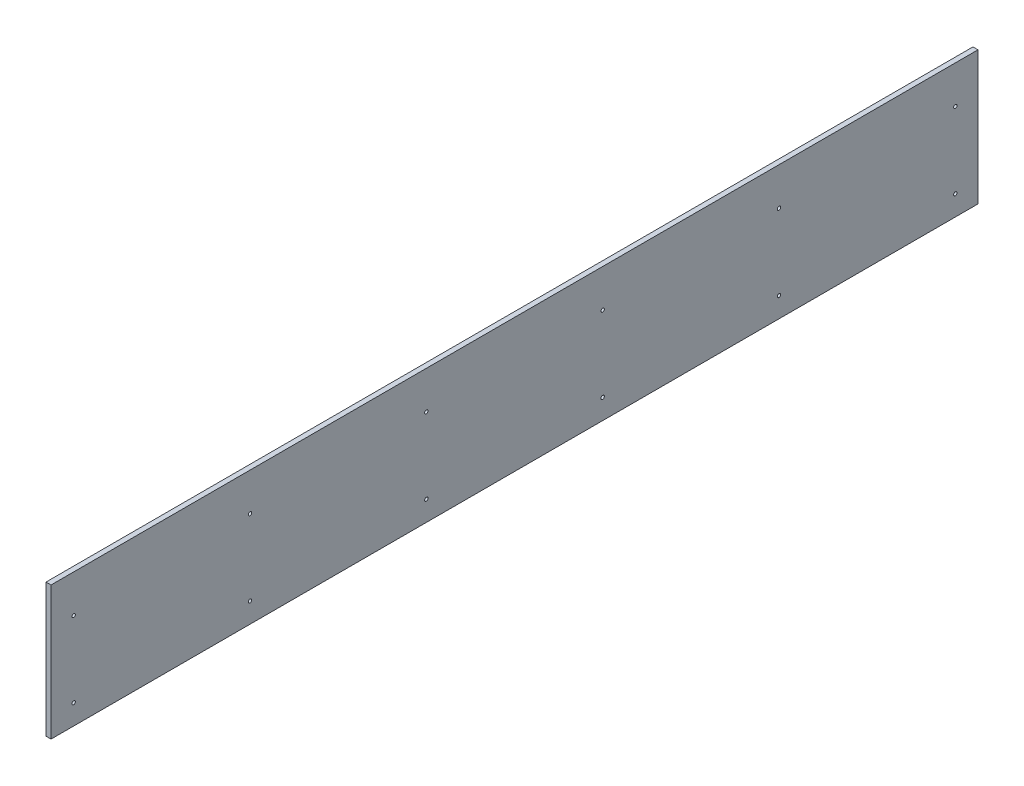
ISO-10303-21;
HEADER;
FILE_DESCRIPTION(('STEP AP214'),'2;1');
FILE_NAME('part.step','',(''),(''),'','','');
FILE_SCHEMA(('AUTOMOTIVE_DESIGN { 1 0 10303 214 1 1 1 1 }'));
ENDSEC;
DATA;
#1=APPLICATION_CONTEXT('core data for automotive mechanical design processes');
#2=APPLICATION_PROTOCOL_DEFINITION('international standard','automotive_design',2000,#1);
#3=PRODUCT_CONTEXT('',#1,'mechanical');
#4=PRODUCT('Part','Part','',(#3));
#5=PRODUCT_RELATED_PRODUCT_CATEGORY('part','',(#4));
#6=PRODUCT_DEFINITION_FORMATION('','',#4);
#7=PRODUCT_DEFINITION_CONTEXT('part definition',#1,'design');
#8=PRODUCT_DEFINITION('design','',#6,#7);
#9=PRODUCT_DEFINITION_SHAPE('','',#8);
#10=(LENGTH_UNIT() NAMED_UNIT(*) SI_UNIT(.MILLI.,.METRE.));
#11=(NAMED_UNIT(*) PLANE_ANGLE_UNIT() SI_UNIT($,.RADIAN.));
#12=(NAMED_UNIT(*) SI_UNIT($,.STERADIAN.) SOLID_ANGLE_UNIT());
#13=UNCERTAINTY_MEASURE_WITH_UNIT(LENGTH_MEASURE(1.E-05),#10,'distance_accuracy_value','');
#14=(GEOMETRIC_REPRESENTATION_CONTEXT(3) GLOBAL_UNCERTAINTY_ASSIGNED_CONTEXT((#13)) GLOBAL_UNIT_ASSIGNED_CONTEXT((#10,
#11,#12)) REPRESENTATION_CONTEXT('',''));
#15=CARTESIAN_POINT('',(0.,0.,0.));
#16=DIRECTION('',(0.,0.,1.));
#17=DIRECTION('',(1.,0.,0.));
#18=AXIS2_PLACEMENT_3D('',#15,#16,#17);
#19=CARTESIAN_POINT('',(0.,0.,0.));
#20=DIRECTION('',(1.,0.,0.));
#21=DIRECTION('',(0.,0.,-1.));
#22=AXIS2_PLACEMENT_3D('',#19,#20,#21);
#23=PLANE('',#22);
#24=CARTESIAN_POINT('',(0.,120.65,-28.575));
#25=DIRECTION('',(-1.,0.,0.));
#26=DIRECTION('',(0.,0.,1.));
#27=AXIS2_PLACEMENT_3D('',#24,#25,#26);
#28=CIRCLE('',#27,4.21640000006491);
#29=CARTESIAN_POINT('',(0.,120.65,-24.3585999999351));
#30=VERTEX_POINT('',#29);
#31=EDGE_CURVE('E68',#30,#30,#28,.F.);
#32=ORIENTED_EDGE('',*,*,#31,.T.);
#33=EDGE_LOOP('',(#32));
#34=FACE_BOUND('',#33,.T.);
#35=CARTESIAN_POINT('',(0.,120.65,-250.825));
#36=DIRECTION('',(-1.,0.,0.));
#37=DIRECTION('',(0.,0.,1.));
#38=AXIS2_PLACEMENT_3D('',#35,#36,#37);
#39=CIRCLE('',#38,4.21640000006491);
#40=CARTESIAN_POINT('',(0.,120.65,-246.608599999935));
#41=VERTEX_POINT('',#40);
#42=EDGE_CURVE('E154',#41,#41,#39,.F.);
#43=ORIENTED_EDGE('',*,*,#42,.T.);
#44=EDGE_LOOP('',(#43));
#45=FACE_BOUND('',#44,.T.);
#46=CARTESIAN_POINT('',(0.,120.65,-473.075));
#47=DIRECTION('',(-1.,0.,0.));
#48=DIRECTION('',(0.,0.,1.));
#49=AXIS2_PLACEMENT_3D('',#46,#47,#48);
#50=CIRCLE('',#49,4.21640000006491);
#51=CARTESIAN_POINT('',(0.,120.65,-468.858599999935));
#52=VERTEX_POINT('',#51);
#53=EDGE_CURVE('E157',#52,#52,#50,.F.);
#54=ORIENTED_EDGE('',*,*,#53,.T.);
#55=EDGE_LOOP('',(#54));
#56=FACE_BOUND('',#55,.T.);
#57=CARTESIAN_POINT('',(0.,120.65,-695.325));
#58=DIRECTION('',(-1.,0.,0.));
#59=DIRECTION('',(0.,0.,1.));
#60=AXIS2_PLACEMENT_3D('',#57,#58,#59);
#61=CIRCLE('',#60,4.21640000006491);
#62=CARTESIAN_POINT('',(0.,120.65,-691.108599999935));
#63=VERTEX_POINT('',#62);
#64=EDGE_CURVE('E160',#63,#63,#61,.F.);
#65=ORIENTED_EDGE('',*,*,#64,.T.);
#66=EDGE_LOOP('',(#65));
#67=FACE_BOUND('',#66,.T.);
#68=CARTESIAN_POINT('',(0.,120.65,-917.575));
#69=DIRECTION('',(-1.,0.,0.));
#70=DIRECTION('',(0.,0.,1.));
#71=AXIS2_PLACEMENT_3D('',#68,#69,#70);
#72=CIRCLE('',#71,4.21640000006491);
#73=CARTESIAN_POINT('',(0.,120.65,-913.358599999935));
#74=VERTEX_POINT('',#73);
#75=EDGE_CURVE('E163',#74,#74,#72,.F.);
#76=ORIENTED_EDGE('',*,*,#75,.T.);
#77=EDGE_LOOP('',(#76));
#78=FACE_BOUND('',#77,.T.);
#79=CARTESIAN_POINT('',(0.,120.65,-1139.825));
#80=DIRECTION('',(-1.,0.,0.));
#81=DIRECTION('',(0.,0.,1.));
#82=AXIS2_PLACEMENT_3D('',#79,#80,#81);
#83=CIRCLE('',#82,4.21640000006491);
#84=CARTESIAN_POINT('',(0.,120.65,-1135.60859999993));
#85=VERTEX_POINT('',#84);
#86=EDGE_CURVE('E166',#85,#85,#83,.F.);
#87=ORIENTED_EDGE('',*,*,#86,.T.);
#88=EDGE_LOOP('',(#87));
#89=FACE_BOUND('',#88,.T.);
#90=CARTESIAN_POINT('',(-5.6843418860808E-11,25.4,-28.575));
#91=DIRECTION('',(-1.,0.,0.));
#92=DIRECTION('',(0.,0.,1.));
#93=AXIS2_PLACEMENT_3D('',#90,#91,#92);
#94=CIRCLE('',#93,4.21640000000898);
#95=CARTESIAN_POINT('',(-5.6843418860808E-11,25.4,-24.358599999991));
#96=VERTEX_POINT('',#95);
#97=EDGE_CURVE('E169',#96,#96,#94,.F.);
#98=ORIENTED_EDGE('',*,*,#97,.T.);
#99=EDGE_LOOP('',(#98));
#100=FACE_BOUND('',#99,.T.);
#101=CARTESIAN_POINT('',(-5.6843418860808E-11,25.4,-250.825));
#102=DIRECTION('',(-1.,0.,0.));
#103=DIRECTION('',(0.,0.,1.));
#104=AXIS2_PLACEMENT_3D('',#101,#102,#103);
#105=CIRCLE('',#104,4.21640000000898);
#106=CARTESIAN_POINT('',(-5.6843418860808E-11,25.4,-246.608599999991));
#107=VERTEX_POINT('',#106);
#108=EDGE_CURVE('E172',#107,#107,#105,.F.);
#109=ORIENTED_EDGE('',*,*,#108,.T.);
#110=EDGE_LOOP('',(#109));
#111=FACE_BOUND('',#110,.T.);
#112=CARTESIAN_POINT('',(-5.6843418860808E-11,25.4,-473.075));
#113=DIRECTION('',(-1.,0.,0.));
#114=DIRECTION('',(0.,0.,1.));
#115=AXIS2_PLACEMENT_3D('',#112,#113,#114);
#116=CIRCLE('',#115,4.21640000000898);
#117=CARTESIAN_POINT('',(-5.6843418860808E-11,25.4,-468.858599999991));
#118=VERTEX_POINT('',#117);
#119=EDGE_CURVE('E175',#118,#118,#116,.F.);
#120=ORIENTED_EDGE('',*,*,#119,.T.);
#121=EDGE_LOOP('',(#120));
#122=FACE_BOUND('',#121,.T.);
#123=CARTESIAN_POINT('',(-5.6843418860808E-11,25.4,-695.325));
#124=DIRECTION('',(-1.,0.,0.));
#125=DIRECTION('',(0.,0.,1.));
#126=AXIS2_PLACEMENT_3D('',#123,#124,#125);
#127=CIRCLE('',#126,4.21640000000898);
#128=CARTESIAN_POINT('',(-5.6843418860808E-11,25.4,-691.108599999991));
#129=VERTEX_POINT('',#128);
#130=EDGE_CURVE('E178',#129,#129,#127,.F.);
#131=ORIENTED_EDGE('',*,*,#130,.T.);
#132=EDGE_LOOP('',(#131));
#133=FACE_BOUND('',#132,.T.);
#134=CARTESIAN_POINT('',(-5.6843418860808E-11,25.4,-917.575));
#135=DIRECTION('',(-1.,0.,0.));
#136=DIRECTION('',(0.,0.,1.));
#137=AXIS2_PLACEMENT_3D('',#134,#135,#136);
#138=CIRCLE('',#137,4.21640000000898);
#139=CARTESIAN_POINT('',(-5.6843418860808E-11,25.4,-913.358599999991));
#140=VERTEX_POINT('',#139);
#141=EDGE_CURVE('E180',#140,#140,#138,.F.);
#142=ORIENTED_EDGE('',*,*,#141,.T.);
#143=EDGE_LOOP('',(#142));
#144=FACE_BOUND('',#143,.T.);
#145=CARTESIAN_POINT('',(-5.6843418860808E-11,25.4,-1139.825));
#146=DIRECTION('',(-1.,0.,0.));
#147=DIRECTION('',(0.,0.,1.));
#148=AXIS2_PLACEMENT_3D('',#145,#146,#147);
#149=CIRCLE('',#148,4.21640000000898);
#150=CARTESIAN_POINT('',(-5.6843418860808E-11,25.4,-1135.60859999999));
#151=VERTEX_POINT('',#150);
#152=EDGE_CURVE('E19',#151,#151,#149,.F.);
#153=ORIENTED_EDGE('',*,*,#152,.T.);
#154=EDGE_LOOP('',(#153));
#155=FACE_BOUND('',#154,.T.);
#156=DIRECTION('',(0.,0.,1.));
#157=VECTOR('',#156,1.);
#158=CARTESIAN_POINT('',(0.,168.275,-1168.4));
#159=LINE('',#158,#157);
#160=CARTESIAN_POINT('',(0.,168.275,-1168.4));
#161=VERTEX_POINT('',#160);
#162=CARTESIAN_POINT('',(0.,168.275,0.));
#163=VERTEX_POINT('',#162);
#164=EDGE_CURVE('E54',#161,#163,#159,.T.);
#165=ORIENTED_EDGE('',*,*,#164,.F.);
#166=DIRECTION('',(0.,1.,0.));
#167=VECTOR('',#166,1.);
#168=CARTESIAN_POINT('',(0.,0.,-1168.4));
#169=LINE('',#168,#167);
#170=CARTESIAN_POINT('',(0.,0.,-1168.4));
#171=VERTEX_POINT('',#170);
#172=EDGE_CURVE('E59',#171,#161,#169,.T.);
#173=ORIENTED_EDGE('',*,*,#172,.F.);
#174=DIRECTION('',(0.,0.,-1.));
#175=VECTOR('',#174,1.);
#176=CARTESIAN_POINT('',(0.,0.,0.));
#177=LINE('',#176,#175);
#178=CARTESIAN_POINT('',(0.,0.,0.));
#179=VERTEX_POINT('',#178);
#180=EDGE_CURVE('E117',#179,#171,#177,.T.);
#181=ORIENTED_EDGE('',*,*,#180,.F.);
#182=DIRECTION('',(0.,1.,0.));
#183=VECTOR('',#182,1.);
#184=CARTESIAN_POINT('',(0.,168.275,0.));
#185=LINE('',#184,#183);
#186=EDGE_CURVE('E70',#163,#179,#185,.F.);
#187=ORIENTED_EDGE('',*,*,#186,.F.);
#188=EDGE_LOOP('',(#165,#173,#181,#187));
#189=FACE_BOUND('',#188,.T.);
#190=ADVANCED_FACE('F16',(#34,#45,#56,#67,#78,#89,#100,#111,#122,#133,#144,#155,#189),#23,.F.);
#191=CARTESIAN_POINT('',(-5.6843418860808E-11,25.4,-1139.825));
#192=DIRECTION('',(-1.,0.,0.));
#193=DIRECTION('',(0.,0.,1.));
#194=AXIS2_PLACEMENT_3D('',#191,#192,#193);
#195=CONICAL_SURFACE('',#194,4.21640000000898,0.715584993325123);
#196=CARTESIAN_POINT('',(2.37407280040243,25.4,-1139.825));
#197=DIRECTION('',(-1.,0.,0.));
#198=DIRECTION('',(0.,0.,1.));
#199=AXIS2_PLACEMENT_3D('',#196,#197,#198);
#200=CIRCLE('',#199,2.15265);
#201=CARTESIAN_POINT('',(2.37407280040243,25.4,-1137.67235));
#202=VERTEX_POINT('',#201);
#203=EDGE_CURVE('E115',#202,#202,#200,.F.);
#204=ORIENTED_EDGE('',*,*,#203,.T.);
#205=EDGE_LOOP('',(#204));
#206=FACE_BOUND('',#205,.T.);
#207=ORIENTED_EDGE('',*,*,#152,.F.);
#208=EDGE_LOOP('',(#207));
#209=FACE_BOUND('',#208,.T.);
#210=ADVANCED_FACE('F188',(#206,#209),#195,.F.);
#211=CARTESIAN_POINT('',(-5.6843418860808E-11,25.4,-917.575));
#212=DIRECTION('',(-1.,0.,0.));
#213=DIRECTION('',(0.,0.,1.));
#214=AXIS2_PLACEMENT_3D('',#211,#212,#213);
#215=CONICAL_SURFACE('',#214,4.21640000000898,0.715584993325123);
#216=CARTESIAN_POINT('',(2.37407280040243,25.4,-917.575));
#217=DIRECTION('',(-1.,0.,0.));
#218=DIRECTION('',(0.,0.,1.));
#219=AXIS2_PLACEMENT_3D('',#216,#217,#218);
#220=CIRCLE('',#219,2.15265);
#221=CARTESIAN_POINT('',(2.37407280040243,25.4,-915.42235));
#222=VERTEX_POINT('',#221);
#223=EDGE_CURVE('E112',#222,#222,#220,.F.);
#224=ORIENTED_EDGE('',*,*,#223,.T.);
#225=EDGE_LOOP('',(#224));
#226=FACE_BOUND('',#225,.T.);
#227=ORIENTED_EDGE('',*,*,#141,.F.);
#228=EDGE_LOOP('',(#227));
#229=FACE_BOUND('',#228,.T.);
#230=ADVANCED_FACE('F190',(#226,#229),#215,.F.);
#231=CARTESIAN_POINT('',(-5.6843418860808E-11,25.4,-695.325));
#232=DIRECTION('',(-1.,0.,0.));
#233=DIRECTION('',(0.,0.,1.));
#234=AXIS2_PLACEMENT_3D('',#231,#232,#233);
#235=CONICAL_SURFACE('',#234,4.21640000000898,0.715584993325123);
#236=CARTESIAN_POINT('',(2.37407280040243,25.4,-695.325));
#237=DIRECTION('',(-1.,0.,0.));
#238=DIRECTION('',(0.,0.,1.));
#239=AXIS2_PLACEMENT_3D('',#236,#237,#238);
#240=CIRCLE('',#239,2.15265);
#241=CARTESIAN_POINT('',(2.37407280040243,25.4,-693.17235));
#242=VERTEX_POINT('',#241);
#243=EDGE_CURVE('E109',#242,#242,#240,.F.);
#244=ORIENTED_EDGE('',*,*,#243,.T.);
#245=EDGE_LOOP('',(#244));
#246=FACE_BOUND('',#245,.T.);
#247=ORIENTED_EDGE('',*,*,#130,.F.);
#248=EDGE_LOOP('',(#247));
#249=FACE_BOUND('',#248,.T.);
#250=ADVANCED_FACE('F197',(#246,#249),#235,.F.);
#251=CARTESIAN_POINT('',(-5.6843418860808E-11,25.4,-473.075));
#252=DIRECTION('',(-1.,0.,0.));
#253=DIRECTION('',(0.,0.,1.));
#254=AXIS2_PLACEMENT_3D('',#251,#252,#253);
#255=CONICAL_SURFACE('',#254,4.21640000000898,0.715584993325123);
#256=CARTESIAN_POINT('',(2.37407280040243,25.4,-473.075));
#257=DIRECTION('',(-1.,0.,0.));
#258=DIRECTION('',(0.,0.,1.));
#259=AXIS2_PLACEMENT_3D('',#256,#257,#258);
#260=CIRCLE('',#259,2.15265);
#261=CARTESIAN_POINT('',(2.37407280040243,25.4,-470.92235));
#262=VERTEX_POINT('',#261);
#263=EDGE_CURVE('E106',#262,#262,#260,.F.);
#264=ORIENTED_EDGE('',*,*,#263,.T.);
#265=EDGE_LOOP('',(#264));
#266=FACE_BOUND('',#265,.T.);
#267=ORIENTED_EDGE('',*,*,#119,.F.);
#268=EDGE_LOOP('',(#267));
#269=FACE_BOUND('',#268,.T.);
#270=ADVANCED_FACE('F299',(#266,#269),#255,.F.);
#271=CARTESIAN_POINT('',(-5.6843418860808E-11,25.4,-250.825));
#272=DIRECTION('',(-1.,0.,0.));
#273=DIRECTION('',(0.,0.,1.));
#274=AXIS2_PLACEMENT_3D('',#271,#272,#273);
#275=CONICAL_SURFACE('',#274,4.21640000000898,0.715584993325123);
#276=CARTESIAN_POINT('',(2.37407280040243,25.4,-250.825));
#277=DIRECTION('',(-1.,0.,0.));
#278=DIRECTION('',(0.,0.,1.));
#279=AXIS2_PLACEMENT_3D('',#276,#277,#278);
#280=CIRCLE('',#279,2.15265);
#281=CARTESIAN_POINT('',(2.37407280040243,25.4,-248.67235));
#282=VERTEX_POINT('',#281);
#283=EDGE_CURVE('E103',#282,#282,#280,.F.);
#284=ORIENTED_EDGE('',*,*,#283,.T.);
#285=EDGE_LOOP('',(#284));
#286=FACE_BOUND('',#285,.T.);
#287=ORIENTED_EDGE('',*,*,#108,.F.);
#288=EDGE_LOOP('',(#287));
#289=FACE_BOUND('',#288,.T.);
#290=ADVANCED_FACE('F295',(#286,#289),#275,.F.);
#291=CARTESIAN_POINT('',(-5.6843418860808E-11,25.4,-28.575));
#292=DIRECTION('',(-1.,0.,0.));
#293=DIRECTION('',(0.,0.,1.));
#294=AXIS2_PLACEMENT_3D('',#291,#292,#293);
#295=CONICAL_SURFACE('',#294,4.21640000000898,0.715584993325123);
#296=CARTESIAN_POINT('',(2.37407280040243,25.4,-28.575));
#297=DIRECTION('',(-1.,0.,0.));
#298=DIRECTION('',(0.,0.,1.));
#299=AXIS2_PLACEMENT_3D('',#296,#297,#298);
#300=CIRCLE('',#299,2.15265);
#301=CARTESIAN_POINT('',(2.37407280040243,25.4,-26.42235));
#302=VERTEX_POINT('',#301);
#303=EDGE_CURVE('E100',#302,#302,#300,.F.);
#304=ORIENTED_EDGE('',*,*,#303,.T.);
#305=EDGE_LOOP('',(#304));
#306=FACE_BOUND('',#305,.T.);
#307=ORIENTED_EDGE('',*,*,#97,.F.);
#308=EDGE_LOOP('',(#307));
#309=FACE_BOUND('',#308,.T.);
#310=ADVANCED_FACE('F291',(#306,#309),#295,.F.);
#311=CARTESIAN_POINT('',(1.70530256582424E-10,120.65,-1139.825));
#312=DIRECTION('',(-1.,0.,0.));
#313=DIRECTION('',(0.,0.,1.));
#314=AXIS2_PLACEMENT_3D('',#311,#312,#313);
#315=CONICAL_SURFACE('',#314,4.21639999991667,0.715584993313268);
#316=CARTESIAN_POINT('',(2.37407280040243,120.65,-1139.825));
#317=DIRECTION('',(-1.,0.,0.));
#318=DIRECTION('',(0.,0.,1.));
#319=AXIS2_PLACEMENT_3D('',#316,#317,#318);
#320=CIRCLE('',#319,2.15265);
#321=CARTESIAN_POINT('',(2.37407280040243,120.65,-1137.67235));
#322=VERTEX_POINT('',#321);
#323=EDGE_CURVE('E97',#322,#322,#320,.F.);
#324=ORIENTED_EDGE('',*,*,#323,.T.);
#325=EDGE_LOOP('',(#324));
#326=FACE_BOUND('',#325,.T.);
#327=ORIENTED_EDGE('',*,*,#86,.F.);
#328=EDGE_LOOP('',(#327));
#329=FACE_BOUND('',#328,.T.);
#330=ADVANCED_FACE('F287',(#326,#329),#315,.F.);
#331=CARTESIAN_POINT('',(1.70530256582424E-10,120.65,-917.575));
#332=DIRECTION('',(-1.,0.,0.));
#333=DIRECTION('',(0.,0.,1.));
#334=AXIS2_PLACEMENT_3D('',#331,#332,#333);
#335=CONICAL_SURFACE('',#334,4.21639999991667,0.715584993313268);
#336=CARTESIAN_POINT('',(2.37407280040243,120.65,-917.575));
#337=DIRECTION('',(-1.,0.,0.));
#338=DIRECTION('',(0.,0.,1.));
#339=AXIS2_PLACEMENT_3D('',#336,#337,#338);
#340=CIRCLE('',#339,2.15265);
#341=CARTESIAN_POINT('',(2.37407280040243,120.65,-915.42235));
#342=VERTEX_POINT('',#341);
#343=EDGE_CURVE('E94',#342,#342,#340,.F.);
#344=ORIENTED_EDGE('',*,*,#343,.T.);
#345=EDGE_LOOP('',(#344));
#346=FACE_BOUND('',#345,.T.);
#347=ORIENTED_EDGE('',*,*,#75,.F.);
#348=EDGE_LOOP('',(#347));
#349=FACE_BOUND('',#348,.T.);
#350=ADVANCED_FACE('F283',(#346,#349),#335,.F.);
#351=CARTESIAN_POINT('',(1.70530256582424E-10,120.65,-695.325));
#352=DIRECTION('',(-1.,0.,0.));
#353=DIRECTION('',(0.,0.,1.));
#354=AXIS2_PLACEMENT_3D('',#351,#352,#353);
#355=CONICAL_SURFACE('',#354,4.21639999991667,0.715584993313268);
#356=CARTESIAN_POINT('',(2.37407280040243,120.65,-695.325));
#357=DIRECTION('',(-1.,0.,0.));
#358=DIRECTION('',(0.,0.,1.));
#359=AXIS2_PLACEMENT_3D('',#356,#357,#358);
#360=CIRCLE('',#359,2.15265);
#361=CARTESIAN_POINT('',(2.37407280040243,120.65,-693.17235));
#362=VERTEX_POINT('',#361);
#363=EDGE_CURVE('E91',#362,#362,#360,.F.);
#364=ORIENTED_EDGE('',*,*,#363,.T.);
#365=EDGE_LOOP('',(#364));
#366=FACE_BOUND('',#365,.T.);
#367=ORIENTED_EDGE('',*,*,#64,.F.);
#368=EDGE_LOOP('',(#367));
#369=FACE_BOUND('',#368,.T.);
#370=ADVANCED_FACE('F279',(#366,#369),#355,.F.);
#371=CARTESIAN_POINT('',(1.70530256582424E-10,120.65,-473.075));
#372=DIRECTION('',(-1.,0.,0.));
#373=DIRECTION('',(0.,0.,1.));
#374=AXIS2_PLACEMENT_3D('',#371,#372,#373);
#375=CONICAL_SURFACE('',#374,4.21639999991667,0.715584993313268);
#376=CARTESIAN_POINT('',(2.37407280040243,120.65,-473.075));
#377=DIRECTION('',(-1.,0.,0.));
#378=DIRECTION('',(0.,0.,1.));
#379=AXIS2_PLACEMENT_3D('',#376,#377,#378);
#380=CIRCLE('',#379,2.15265);
#381=CARTESIAN_POINT('',(2.37407280040243,120.65,-470.92235));
#382=VERTEX_POINT('',#381);
#383=EDGE_CURVE('E88',#382,#382,#380,.F.);
#384=ORIENTED_EDGE('',*,*,#383,.T.);
#385=EDGE_LOOP('',(#384));
#386=FACE_BOUND('',#385,.T.);
#387=ORIENTED_EDGE('',*,*,#53,.F.);
#388=EDGE_LOOP('',(#387));
#389=FACE_BOUND('',#388,.T.);
#390=ADVANCED_FACE('F275',(#386,#389),#375,.F.);
#391=CARTESIAN_POINT('',(1.70530256582424E-10,120.65,-250.825));
#392=DIRECTION('',(-1.,0.,0.));
#393=DIRECTION('',(0.,0.,1.));
#394=AXIS2_PLACEMENT_3D('',#391,#392,#393);
#395=CONICAL_SURFACE('',#394,4.21639999991667,0.715584993313268);
#396=CARTESIAN_POINT('',(2.37407280040243,120.65,-250.825));
#397=DIRECTION('',(-1.,0.,0.));
#398=DIRECTION('',(0.,0.,1.));
#399=AXIS2_PLACEMENT_3D('',#396,#397,#398);
#400=CIRCLE('',#399,2.15265);
#401=CARTESIAN_POINT('',(2.37407280040243,120.65,-248.67235));
#402=VERTEX_POINT('',#401);
#403=EDGE_CURVE('E85',#402,#402,#400,.F.);
#404=ORIENTED_EDGE('',*,*,#403,.T.);
#405=EDGE_LOOP('',(#404));
#406=FACE_BOUND('',#405,.T.);
#407=ORIENTED_EDGE('',*,*,#42,.F.);
#408=EDGE_LOOP('',(#407));
#409=FACE_BOUND('',#408,.T.);
#410=ADVANCED_FACE('F271',(#406,#409),#395,.F.);
#411=CARTESIAN_POINT('',(1.70530256582424E-10,120.65,-28.575));
#412=DIRECTION('',(-1.,0.,0.));
#413=DIRECTION('',(0.,0.,1.));
#414=AXIS2_PLACEMENT_3D('',#411,#412,#413);
#415=CONICAL_SURFACE('',#414,4.21639999991667,0.715584993313268);
#416=CARTESIAN_POINT('',(2.37407280040243,120.65,-28.575));
#417=DIRECTION('',(-1.,0.,0.));
#418=DIRECTION('',(0.,0.,1.));
#419=AXIS2_PLACEMENT_3D('',#416,#417,#418);
#420=CIRCLE('',#419,2.15265);
#421=CARTESIAN_POINT('',(2.37407280040243,120.65,-26.42235));
#422=VERTEX_POINT('',#421);
#423=EDGE_CURVE('E81',#422,#422,#420,.F.);
#424=ORIENTED_EDGE('',*,*,#423,.T.);
#425=EDGE_LOOP('',(#424));
#426=FACE_BOUND('',#425,.T.);
#427=ORIENTED_EDGE('',*,*,#31,.F.);
#428=EDGE_LOOP('',(#427));
#429=FACE_BOUND('',#428,.T.);
#430=ADVANCED_FACE('F268',(#426,#429),#415,.F.);
#431=CARTESIAN_POINT('',(0.,0.,-1168.4));
#432=DIRECTION('',(0.,0.,-1.));
#433=DIRECTION('',(-1.,0.,0.));
#434=AXIS2_PLACEMENT_3D('',#431,#432,#433);
#435=PLANE('',#434);
#436=DIRECTION('',(1.,0.,0.));
#437=VECTOR('',#436,1.);
#438=CARTESIAN_POINT('',(0.,0.,-1168.4));
#439=LINE('',#438,#437);
#440=CARTESIAN_POINT('',(6.35,0.,-1168.4));
#441=VERTEX_POINT('',#440);
#442=EDGE_CURVE('E64',#171,#441,#439,.T.);
#443=ORIENTED_EDGE('',*,*,#442,.F.);
#444=ORIENTED_EDGE('',*,*,#172,.T.);
#445=DIRECTION('',(1.,0.,0.));
#446=VECTOR('',#445,1.);
#447=CARTESIAN_POINT('',(0.,168.275,-1168.4));
#448=LINE('',#447,#446);
#449=CARTESIAN_POINT('',(6.35,168.275,-1168.4));
#450=VERTEX_POINT('',#449);
#451=EDGE_CURVE('E61',#450,#161,#448,.F.);
#452=ORIENTED_EDGE('',*,*,#451,.F.);
#453=DIRECTION('',(0.,1.,0.));
#454=VECTOR('',#453,1.);
#455=CARTESIAN_POINT('',(6.35,0.,-1168.4));
#456=LINE('',#455,#454);
#457=EDGE_CURVE('E84',#441,#450,#456,.T.);
#458=ORIENTED_EDGE('',*,*,#457,.F.);
#459=EDGE_LOOP('',(#443,#444,#452,#458));
#460=FACE_BOUND('',#459,.T.);
#461=ADVANCED_FACE('F60',(#460),#435,.T.);
#462=CARTESIAN_POINT('',(0.,168.275,-1168.4));
#463=DIRECTION('',(0.,1.,0.));
#464=DIRECTION('',(0.,0.,1.));
#465=AXIS2_PLACEMENT_3D('',#462,#463,#464);
#466=PLANE('',#465);
#467=ORIENTED_EDGE('',*,*,#451,.T.);
#468=ORIENTED_EDGE('',*,*,#164,.T.);
#469=DIRECTION('',(1.,0.,0.));
#470=VECTOR('',#469,1.);
#471=CARTESIAN_POINT('',(0.,168.275,0.));
#472=LINE('',#471,#470);
#473=CARTESIAN_POINT('',(6.35,168.275,0.));
#474=VERTEX_POINT('',#473);
#475=EDGE_CURVE('E72',#474,#163,#472,.F.);
#476=ORIENTED_EDGE('',*,*,#475,.F.);
#477=DIRECTION('',(0.,0.,-1.));
#478=VECTOR('',#477,1.);
#479=CARTESIAN_POINT('',(6.35,168.275,0.));
#480=LINE('',#479,#478);
#481=EDGE_CURVE('E76',#450,#474,#480,.F.);
#482=ORIENTED_EDGE('',*,*,#481,.F.);
#483=EDGE_LOOP('',(#467,#468,#476,#482));
#484=FACE_BOUND('',#483,.T.);
#485=ADVANCED_FACE('F74',(#484),#466,.T.);
#486=CARTESIAN_POINT('',(0.,168.275,0.));
#487=DIRECTION('',(0.,0.,1.));
#488=DIRECTION('',(1.,0.,0.));
#489=AXIS2_PLACEMENT_3D('',#486,#487,#488);
#490=PLANE('',#489);
#491=ORIENTED_EDGE('',*,*,#475,.T.);
#492=ORIENTED_EDGE('',*,*,#186,.T.);
#493=DIRECTION('',(1.,0.,0.));
#494=VECTOR('',#493,1.);
#495=CARTESIAN_POINT('',(0.,0.,0.));
#496=LINE('',#495,#494);
#497=CARTESIAN_POINT('',(6.35,0.,0.));
#498=VERTEX_POINT('',#497);
#499=EDGE_CURVE('E34',#498,#179,#496,.F.);
#500=ORIENTED_EDGE('',*,*,#499,.F.);
#501=DIRECTION('',(0.,1.,0.));
#502=VECTOR('',#501,1.);
#503=CARTESIAN_POINT('',(6.35,0.,0.));
#504=LINE('',#503,#502);
#505=EDGE_CURVE('E322',#474,#498,#504,.F.);
#506=ORIENTED_EDGE('',*,*,#505,.F.);
#507=EDGE_LOOP('',(#491,#492,#500,#506));
#508=FACE_BOUND('',#507,.T.);
#509=ADVANCED_FACE('F260',(#508),#490,.T.);
#510=CARTESIAN_POINT('',(0.,0.,0.));
#511=DIRECTION('',(0.,-1.,0.));
#512=DIRECTION('',(0.,0.,-1.));
#513=AXIS2_PLACEMENT_3D('',#510,#511,#512);
#514=PLANE('',#513);
#515=ORIENTED_EDGE('',*,*,#499,.T.);
#516=ORIENTED_EDGE('',*,*,#180,.T.);
#517=ORIENTED_EDGE('',*,*,#442,.T.);
#518=DIRECTION('',(0.,0.,-1.));
#519=VECTOR('',#518,1.);
#520=CARTESIAN_POINT('',(6.35,0.,0.));
#521=LINE('',#520,#519);
#522=EDGE_CURVE('E151',#498,#441,#521,.T.);
#523=ORIENTED_EDGE('',*,*,#522,.F.);
#524=EDGE_LOOP('',(#515,#516,#517,#523));
#525=FACE_BOUND('',#524,.T.);
#526=ADVANCED_FACE('F256',(#525),#514,.T.);
#527=CARTESIAN_POINT('',(7.9069465606625,25.4,-1139.825));
#528=DIRECTION('',(-1.,0.,0.));
#529=DIRECTION('',(0.,0.,1.));
#530=AXIS2_PLACEMENT_3D('',#527,#528,#529);
#531=CYLINDRICAL_SURFACE('',#530,2.15265);
#532=ORIENTED_EDGE('',*,*,#203,.F.);
#533=EDGE_LOOP('',(#532));
#534=FACE_BOUND('',#533,.T.);
#535=CARTESIAN_POINT('',(6.35,25.4,-1139.825));
#536=DIRECTION('',(-1.,0.,0.));
#537=DIRECTION('',(0.,0.,1.));
#538=AXIS2_PLACEMENT_3D('',#535,#536,#537);
#539=CIRCLE('',#538,2.15265);
#540=CARTESIAN_POINT('',(6.35,25.4,-1137.67235));
#541=VERTEX_POINT('',#540);
#542=EDGE_CURVE('E148',#541,#541,#539,.T.);
#543=ORIENTED_EDGE('',*,*,#542,.F.);
#544=EDGE_LOOP('',(#543));
#545=FACE_BOUND('',#544,.T.);
#546=ADVANCED_FACE('F252',(#534,#545),#531,.F.);
#547=CARTESIAN_POINT('',(7.9069465606625,25.4,-917.575));
#548=DIRECTION('',(-1.,0.,0.));
#549=DIRECTION('',(0.,0.,1.));
#550=AXIS2_PLACEMENT_3D('',#547,#548,#549);
#551=CYLINDRICAL_SURFACE('',#550,2.15265);
#552=ORIENTED_EDGE('',*,*,#223,.F.);
#553=EDGE_LOOP('',(#552));
#554=FACE_BOUND('',#553,.T.);
#555=CARTESIAN_POINT('',(6.35,25.4,-917.575));
#556=DIRECTION('',(-1.,0.,0.));
#557=DIRECTION('',(0.,0.,1.));
#558=AXIS2_PLACEMENT_3D('',#555,#556,#557);
#559=CIRCLE('',#558,2.15265);
#560=CARTESIAN_POINT('',(6.35,25.4,-915.42235));
#561=VERTEX_POINT('',#560);
#562=EDGE_CURVE('E145',#561,#561,#559,.T.);
#563=ORIENTED_EDGE('',*,*,#562,.F.);
#564=EDGE_LOOP('',(#563));
#565=FACE_BOUND('',#564,.T.);
#566=ADVANCED_FACE('F248',(#554,#565),#551,.F.);
#567=CARTESIAN_POINT('',(7.9069465606625,25.4,-695.325));
#568=DIRECTION('',(-1.,0.,0.));
#569=DIRECTION('',(0.,0.,1.));
#570=AXIS2_PLACEMENT_3D('',#567,#568,#569);
#571=CYLINDRICAL_SURFACE('',#570,2.15265);
#572=ORIENTED_EDGE('',*,*,#243,.F.);
#573=EDGE_LOOP('',(#572));
#574=FACE_BOUND('',#573,.T.);
#575=CARTESIAN_POINT('',(6.35,25.4,-695.325));
#576=DIRECTION('',(-1.,0.,0.));
#577=DIRECTION('',(0.,0.,1.));
#578=AXIS2_PLACEMENT_3D('',#575,#576,#577);
#579=CIRCLE('',#578,2.15265);
#580=CARTESIAN_POINT('',(6.35,25.4,-693.17235));
#581=VERTEX_POINT('',#580);
#582=EDGE_CURVE('E142',#581,#581,#579,.T.);
#583=ORIENTED_EDGE('',*,*,#582,.F.);
#584=EDGE_LOOP('',(#583));
#585=FACE_BOUND('',#584,.T.);
#586=ADVANCED_FACE('F244',(#574,#585),#571,.F.);
#587=CARTESIAN_POINT('',(7.9069465606625,25.4,-473.075));
#588=DIRECTION('',(-1.,0.,0.));
#589=DIRECTION('',(0.,0.,1.));
#590=AXIS2_PLACEMENT_3D('',#587,#588,#589);
#591=CYLINDRICAL_SURFACE('',#590,2.15265);
#592=ORIENTED_EDGE('',*,*,#263,.F.);
#593=EDGE_LOOP('',(#592));
#594=FACE_BOUND('',#593,.T.);
#595=CARTESIAN_POINT('',(6.35,25.4,-473.075));
#596=DIRECTION('',(-1.,0.,0.));
#597=DIRECTION('',(0.,0.,1.));
#598=AXIS2_PLACEMENT_3D('',#595,#596,#597);
#599=CIRCLE('',#598,2.15265);
#600=CARTESIAN_POINT('',(6.35,25.4,-470.92235));
#601=VERTEX_POINT('',#600);
#602=EDGE_CURVE('E139',#601,#601,#599,.T.);
#603=ORIENTED_EDGE('',*,*,#602,.F.);
#604=EDGE_LOOP('',(#603));
#605=FACE_BOUND('',#604,.T.);
#606=ADVANCED_FACE('F240',(#594,#605),#591,.F.);
#607=CARTESIAN_POINT('',(7.9069465606625,25.4,-250.825));
#608=DIRECTION('',(-1.,0.,0.));
#609=DIRECTION('',(0.,0.,1.));
#610=AXIS2_PLACEMENT_3D('',#607,#608,#609);
#611=CYLINDRICAL_SURFACE('',#610,2.15265);
#612=ORIENTED_EDGE('',*,*,#283,.F.);
#613=EDGE_LOOP('',(#612));
#614=FACE_BOUND('',#613,.T.);
#615=CARTESIAN_POINT('',(6.35,25.4,-250.825));
#616=DIRECTION('',(-1.,0.,0.));
#617=DIRECTION('',(0.,0.,1.));
#618=AXIS2_PLACEMENT_3D('',#615,#616,#617);
#619=CIRCLE('',#618,2.15265);
#620=CARTESIAN_POINT('',(6.35,25.4,-248.67235));
#621=VERTEX_POINT('',#620);
#622=EDGE_CURVE('E136',#621,#621,#619,.T.);
#623=ORIENTED_EDGE('',*,*,#622,.F.);
#624=EDGE_LOOP('',(#623));
#625=FACE_BOUND('',#624,.T.);
#626=ADVANCED_FACE('F236',(#614,#625),#611,.F.);
#627=CARTESIAN_POINT('',(7.9069465606625,25.4,-28.575));
#628=DIRECTION('',(-1.,0.,0.));
#629=DIRECTION('',(0.,0.,1.));
#630=AXIS2_PLACEMENT_3D('',#627,#628,#629);
#631=CYLINDRICAL_SURFACE('',#630,2.15265);
#632=ORIENTED_EDGE('',*,*,#303,.F.);
#633=EDGE_LOOP('',(#632));
#634=FACE_BOUND('',#633,.T.);
#635=CARTESIAN_POINT('',(6.35,25.4,-28.575));
#636=DIRECTION('',(-1.,0.,0.));
#637=DIRECTION('',(0.,0.,1.));
#638=AXIS2_PLACEMENT_3D('',#635,#636,#637);
#639=CIRCLE('',#638,2.15265);
#640=CARTESIAN_POINT('',(6.35,25.4,-26.42235));
#641=VERTEX_POINT('',#640);
#642=EDGE_CURVE('E133',#641,#641,#639,.T.);
#643=ORIENTED_EDGE('',*,*,#642,.F.);
#644=EDGE_LOOP('',(#643));
#645=FACE_BOUND('',#644,.T.);
#646=ADVANCED_FACE('F232',(#634,#645),#631,.F.);
#647=CARTESIAN_POINT('',(7.9069465606625,120.65,-1139.825));
#648=DIRECTION('',(-1.,0.,0.));
#649=DIRECTION('',(0.,0.,1.));
#650=AXIS2_PLACEMENT_3D('',#647,#648,#649);
#651=CYLINDRICAL_SURFACE('',#650,2.15265);
#652=ORIENTED_EDGE('',*,*,#323,.F.);
#653=EDGE_LOOP('',(#652));
#654=FACE_BOUND('',#653,.T.);
#655=CARTESIAN_POINT('',(6.35,120.65,-1139.825));
#656=DIRECTION('',(-1.,0.,0.));
#657=DIRECTION('',(0.,0.,1.));
#658=AXIS2_PLACEMENT_3D('',#655,#656,#657);
#659=CIRCLE('',#658,2.15265);
#660=CARTESIAN_POINT('',(6.35,120.65,-1137.67235));
#661=VERTEX_POINT('',#660);
#662=EDGE_CURVE('E130',#661,#661,#659,.T.);
#663=ORIENTED_EDGE('',*,*,#662,.F.);
#664=EDGE_LOOP('',(#663));
#665=FACE_BOUND('',#664,.T.);
#666=ADVANCED_FACE('F228',(#654,#665),#651,.F.);
#667=CARTESIAN_POINT('',(7.9069465606625,120.65,-917.575));
#668=DIRECTION('',(-1.,0.,0.));
#669=DIRECTION('',(0.,0.,1.));
#670=AXIS2_PLACEMENT_3D('',#667,#668,#669);
#671=CYLINDRICAL_SURFACE('',#670,2.15265);
#672=ORIENTED_EDGE('',*,*,#343,.F.);
#673=EDGE_LOOP('',(#672));
#674=FACE_BOUND('',#673,.T.);
#675=CARTESIAN_POINT('',(6.35,120.65,-917.575));
#676=DIRECTION('',(-1.,0.,0.));
#677=DIRECTION('',(0.,0.,1.));
#678=AXIS2_PLACEMENT_3D('',#675,#676,#677);
#679=CIRCLE('',#678,2.15265);
#680=CARTESIAN_POINT('',(6.35,120.65,-915.42235));
#681=VERTEX_POINT('',#680);
#682=EDGE_CURVE('E127',#681,#681,#679,.T.);
#683=ORIENTED_EDGE('',*,*,#682,.F.);
#684=EDGE_LOOP('',(#683));
#685=FACE_BOUND('',#684,.T.);
#686=ADVANCED_FACE('F224',(#674,#685),#671,.F.);
#687=CARTESIAN_POINT('',(7.9069465606625,120.65,-695.325));
#688=DIRECTION('',(-1.,0.,0.));
#689=DIRECTION('',(0.,0.,1.));
#690=AXIS2_PLACEMENT_3D('',#687,#688,#689);
#691=CYLINDRICAL_SURFACE('',#690,2.15265);
#692=ORIENTED_EDGE('',*,*,#363,.F.);
#693=EDGE_LOOP('',(#692));
#694=FACE_BOUND('',#693,.T.);
#695=CARTESIAN_POINT('',(6.35,120.65,-695.325));
#696=DIRECTION('',(-1.,0.,0.));
#697=DIRECTION('',(0.,0.,1.));
#698=AXIS2_PLACEMENT_3D('',#695,#696,#697);
#699=CIRCLE('',#698,2.15265);
#700=CARTESIAN_POINT('',(6.35,120.65,-693.17235));
#701=VERTEX_POINT('',#700);
#702=EDGE_CURVE('E124',#701,#701,#699,.T.);
#703=ORIENTED_EDGE('',*,*,#702,.F.);
#704=EDGE_LOOP('',(#703));
#705=FACE_BOUND('',#704,.T.);
#706=ADVANCED_FACE('F220',(#694,#705),#691,.F.);
#707=CARTESIAN_POINT('',(7.9069465606625,120.65,-473.075));
#708=DIRECTION('',(-1.,0.,0.));
#709=DIRECTION('',(0.,0.,1.));
#710=AXIS2_PLACEMENT_3D('',#707,#708,#709);
#711=CYLINDRICAL_SURFACE('',#710,2.15265);
#712=ORIENTED_EDGE('',*,*,#383,.F.);
#713=EDGE_LOOP('',(#712));
#714=FACE_BOUND('',#713,.T.);
#715=CARTESIAN_POINT('',(6.35,120.65,-473.075));
#716=DIRECTION('',(-1.,0.,0.));
#717=DIRECTION('',(0.,0.,1.));
#718=AXIS2_PLACEMENT_3D('',#715,#716,#717);
#719=CIRCLE('',#718,2.15265);
#720=CARTESIAN_POINT('',(6.35,120.65,-470.92235));
#721=VERTEX_POINT('',#720);
#722=EDGE_CURVE('E121',#721,#721,#719,.T.);
#723=ORIENTED_EDGE('',*,*,#722,.F.);
#724=EDGE_LOOP('',(#723));
#725=FACE_BOUND('',#724,.T.);
#726=ADVANCED_FACE('F216',(#714,#725),#711,.F.);
#727=CARTESIAN_POINT('',(7.9069465606625,120.65,-250.825));
#728=DIRECTION('',(-1.,0.,0.));
#729=DIRECTION('',(0.,0.,1.));
#730=AXIS2_PLACEMENT_3D('',#727,#728,#729);
#731=CYLINDRICAL_SURFACE('',#730,2.15265);
#732=ORIENTED_EDGE('',*,*,#403,.F.);
#733=EDGE_LOOP('',(#732));
#734=FACE_BOUND('',#733,.T.);
#735=CARTESIAN_POINT('',(6.35,120.65,-250.825));
#736=DIRECTION('',(-1.,0.,0.));
#737=DIRECTION('',(0.,0.,1.));
#738=AXIS2_PLACEMENT_3D('',#735,#736,#737);
#739=CIRCLE('',#738,2.15265);
#740=CARTESIAN_POINT('',(6.35,120.65,-248.67235));
#741=VERTEX_POINT('',#740);
#742=EDGE_CURVE('E25',#741,#741,#739,.T.);
#743=ORIENTED_EDGE('',*,*,#742,.F.);
#744=EDGE_LOOP('',(#743));
#745=FACE_BOUND('',#744,.T.);
#746=ADVANCED_FACE('F209',(#734,#745),#731,.F.);
#747=CARTESIAN_POINT('',(7.9069465606625,120.65,-28.575));
#748=DIRECTION('',(-1.,0.,0.));
#749=DIRECTION('',(0.,0.,1.));
#750=AXIS2_PLACEMENT_3D('',#747,#748,#749);
#751=CYLINDRICAL_SURFACE('',#750,2.15265);
#752=ORIENTED_EDGE('',*,*,#423,.F.);
#753=EDGE_LOOP('',(#752));
#754=FACE_BOUND('',#753,.T.);
#755=CARTESIAN_POINT('',(6.35,120.65,-28.575));
#756=DIRECTION('',(-1.,0.,0.));
#757=DIRECTION('',(0.,0.,1.));
#758=AXIS2_PLACEMENT_3D('',#755,#756,#757);
#759=CIRCLE('',#758,2.15265);
#760=CARTESIAN_POINT('',(6.35,120.65,-26.42235));
#761=VERTEX_POINT('',#760);
#762=EDGE_CURVE('E11',#761,#761,#759,.T.);
#763=ORIENTED_EDGE('',*,*,#762,.F.);
#764=EDGE_LOOP('',(#763));
#765=FACE_BOUND('',#764,.T.);
#766=ADVANCED_FACE('F203',(#754,#765),#751,.F.);
#767=CARTESIAN_POINT('',(6.35,0.,0.));
#768=DIRECTION('',(1.,0.,0.));
#769=DIRECTION('',(0.,0.,-1.));
#770=AXIS2_PLACEMENT_3D('',#767,#768,#769);
#771=PLANE('',#770);
#772=ORIENTED_EDGE('',*,*,#762,.T.);
#773=EDGE_LOOP('',(#772));
#774=FACE_BOUND('',#773,.T.);
#775=ORIENTED_EDGE('',*,*,#742,.T.);
#776=EDGE_LOOP('',(#775));
#777=FACE_BOUND('',#776,.T.);
#778=ORIENTED_EDGE('',*,*,#722,.T.);
#779=EDGE_LOOP('',(#778));
#780=FACE_BOUND('',#779,.T.);
#781=ORIENTED_EDGE('',*,*,#702,.T.);
#782=EDGE_LOOP('',(#781));
#783=FACE_BOUND('',#782,.T.);
#784=ORIENTED_EDGE('',*,*,#682,.T.);
#785=EDGE_LOOP('',(#784));
#786=FACE_BOUND('',#785,.T.);
#787=ORIENTED_EDGE('',*,*,#662,.T.);
#788=EDGE_LOOP('',(#787));
#789=FACE_BOUND('',#788,.T.);
#790=ORIENTED_EDGE('',*,*,#642,.T.);
#791=EDGE_LOOP('',(#790));
#792=FACE_BOUND('',#791,.T.);
#793=ORIENTED_EDGE('',*,*,#622,.T.);
#794=EDGE_LOOP('',(#793));
#795=FACE_BOUND('',#794,.T.);
#796=ORIENTED_EDGE('',*,*,#602,.T.);
#797=EDGE_LOOP('',(#796));
#798=FACE_BOUND('',#797,.T.);
#799=ORIENTED_EDGE('',*,*,#582,.T.);
#800=EDGE_LOOP('',(#799));
#801=FACE_BOUND('',#800,.T.);
#802=ORIENTED_EDGE('',*,*,#562,.T.);
#803=EDGE_LOOP('',(#802));
#804=FACE_BOUND('',#803,.T.);
#805=ORIENTED_EDGE('',*,*,#542,.T.);
#806=EDGE_LOOP('',(#805));
#807=FACE_BOUND('',#806,.T.);
#808=ORIENTED_EDGE('',*,*,#505,.T.);
#809=ORIENTED_EDGE('',*,*,#522,.T.);
#810=ORIENTED_EDGE('',*,*,#457,.T.);
#811=ORIENTED_EDGE('',*,*,#481,.T.);
#812=EDGE_LOOP('',(#808,#809,#810,#811));
#813=FACE_BOUND('',#812,.T.);
#814=ADVANCED_FACE('F201',(#774,#777,#780,#783,#786,#789,#792,#795,#798,#801,#804,#807,#813),
#771,.T.);
#815=CLOSED_SHELL('',(#190,#210,#230,#250,#270,#290,#310,#330,#350,#370,#390,#410,#430,#461,
#485,#509,#526,#546,#566,#586,#606,#626,#646,#666,#686,#706,#726,#746,#766,#814));
#816=MANIFOLD_SOLID_BREP('B1',#815);
#817=ADVANCED_BREP_SHAPE_REPRESENTATION('',(#18,#816),#14);
#818=SHAPE_DEFINITION_REPRESENTATION(#9,#817);
ENDSEC;
END-ISO-10303-21;
